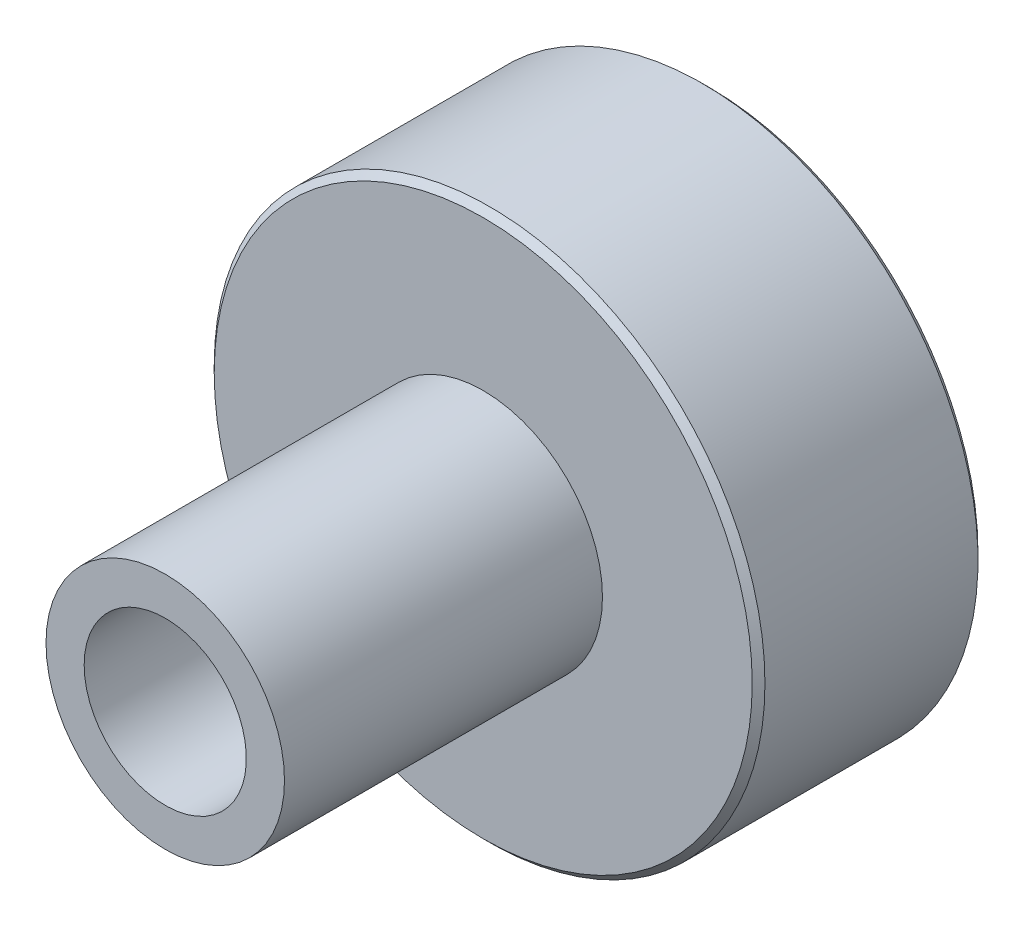
ISO-10303-21;
HEADER;
FILE_DESCRIPTION(('STEP AP214'),'2;1');
FILE_NAME('part.step','',(''),(''),'','','');
FILE_SCHEMA(('AUTOMOTIVE_DESIGN { 1 0 10303 214 1 1 1 1 }'));
ENDSEC;
DATA;
#1=APPLICATION_CONTEXT('core data for automotive mechanical design processes');
#2=APPLICATION_PROTOCOL_DEFINITION('international standard','automotive_design',2000,#1);
#3=PRODUCT_CONTEXT('',#1,'mechanical');
#4=PRODUCT('Part','Part','',(#3));
#5=PRODUCT_RELATED_PRODUCT_CATEGORY('part','',(#4));
#6=PRODUCT_DEFINITION_FORMATION('','',#4);
#7=PRODUCT_DEFINITION_CONTEXT('part definition',#1,'design');
#8=PRODUCT_DEFINITION('design','',#6,#7);
#9=PRODUCT_DEFINITION_SHAPE('','',#8);
#10=(LENGTH_UNIT() NAMED_UNIT(*) SI_UNIT(.MILLI.,.METRE.));
#11=(NAMED_UNIT(*) PLANE_ANGLE_UNIT() SI_UNIT($,.RADIAN.));
#12=(NAMED_UNIT(*) SI_UNIT($,.STERADIAN.) SOLID_ANGLE_UNIT());
#13=UNCERTAINTY_MEASURE_WITH_UNIT(LENGTH_MEASURE(1.E-05),#10,'distance_accuracy_value','');
#14=(GEOMETRIC_REPRESENTATION_CONTEXT(3) GLOBAL_UNCERTAINTY_ASSIGNED_CONTEXT((#13)) GLOBAL_UNIT_ASSIGNED_CONTEXT((#10,
#11,#12)) REPRESENTATION_CONTEXT('',''));
#15=CARTESIAN_POINT('',(0.,0.,0.));
#16=DIRECTION('',(0.,0.,1.));
#17=DIRECTION('',(1.,0.,0.));
#18=AXIS2_PLACEMENT_3D('',#15,#16,#17);
#19=CARTESIAN_POINT('',(0.,0.,12.7));
#20=DIRECTION('',(0.,0.,-1.));
#21=DIRECTION('',(-1.,0.,0.));
#22=AXIS2_PLACEMENT_3D('',#19,#20,#21);
#23=CYLINDRICAL_SURFACE('',#22,3.2385);
#24=CARTESIAN_POINT('',(0.,0.,12.7));
#25=DIRECTION('',(0.,0.,-1.));
#26=DIRECTION('',(-1.,0.,0.));
#27=AXIS2_PLACEMENT_3D('',#24,#25,#26);
#28=CIRCLE('',#27,3.2385);
#29=CARTESIAN_POINT('',(-3.2385,0.,12.7));
#30=VERTEX_POINT('',#29);
#31=EDGE_CURVE('E38',#30,#30,#28,.T.);
#32=ORIENTED_EDGE('',*,*,#31,.F.);
#33=EDGE_LOOP('',(#32));
#34=FACE_BOUND('',#33,.T.);
#35=CARTESIAN_POINT('',(0.,0.,-1.27));
#36=DIRECTION('',(0.,0.,-1.));
#37=DIRECTION('',(-1.,0.,0.));
#38=AXIS2_PLACEMENT_3D('',#35,#36,#37);
#39=CIRCLE('',#38,3.2385);
#40=CARTESIAN_POINT('',(-3.2385,0.,-1.27));
#41=VERTEX_POINT('',#40);
#42=EDGE_CURVE('E35',#41,#41,#39,.F.);
#43=ORIENTED_EDGE('',*,*,#42,.F.);
#44=EDGE_LOOP('',(#43));
#45=FACE_BOUND('',#44,.T.);
#46=ADVANCED_FACE('F14',(#34,#45),#23,.F.);
#47=CARTESIAN_POINT('',(0.,0.,-9.017));
#48=DIRECTION('',(0.,0.,-1.));
#49=DIRECTION('',(-1.,0.,0.));
#50=AXIS2_PLACEMENT_3D('',#47,#48,#49);
#51=PLANE('',#50);
#52=CARTESIAN_POINT('',(0.,0.,-9.017));
#53=DIRECTION('',(0.,0.,-1.));
#54=DIRECTION('',(-1.,0.,0.));
#55=AXIS2_PLACEMENT_3D('',#52,#53,#54);
#56=CIRCLE('',#55,10.7442);
#57=CARTESIAN_POINT('',(-10.7442,0.,-9.017));
#58=VERTEX_POINT('',#57);
#59=EDGE_CURVE('E29',#58,#58,#56,.T.);
#60=ORIENTED_EDGE('',*,*,#59,.T.);
#61=EDGE_LOOP('',(#60));
#62=FACE_BOUND('',#61,.T.);
#63=CARTESIAN_POINT('',(0.,0.,-9.017));
#64=DIRECTION('',(0.,0.,-1.));
#65=DIRECTION('',(-1.,0.,0.));
#66=AXIS2_PLACEMENT_3D('',#63,#64,#65);
#67=CIRCLE('',#66,5.08);
#68=CARTESIAN_POINT('',(-5.08,0.,-9.017));
#69=VERTEX_POINT('',#68);
#70=EDGE_CURVE('E47',#69,#69,#67,.T.);
#71=ORIENTED_EDGE('',*,*,#70,.F.);
#72=EDGE_LOOP('',(#71));
#73=FACE_BOUND('',#72,.T.);
#74=ADVANCED_FACE('F63',(#62,#73),#51,.T.);
#75=CARTESIAN_POINT('',(0.,0.,-78.9136340269278));
#76=DIRECTION('',(0.,0.,-1.));
#77=DIRECTION('',(-1.,0.,0.));
#78=AXIS2_PLACEMENT_3D('',#75,#76,#77);
#79=CYLINDRICAL_SURFACE('',#78,10.9982);
#80=CARTESIAN_POINT('',(0.,0.,-8.763));
#81=DIRECTION('',(0.,0.,-1.));
#82=DIRECTION('',(-1.,0.,0.));
#83=AXIS2_PLACEMENT_3D('',#80,#81,#82);
#84=CIRCLE('',#83,10.9982);
#85=CARTESIAN_POINT('',(-10.9982,0.,-8.763));
#86=VERTEX_POINT('',#85);
#87=EDGE_CURVE('E21',#86,#86,#84,.F.);
#88=ORIENTED_EDGE('',*,*,#87,.T.);
#89=EDGE_LOOP('',(#88));
#90=FACE_BOUND('',#89,.T.);
#91=CARTESIAN_POINT('',(0.,0.,-0.254000000000008));
#92=DIRECTION('',(0.,0.,1.));
#93=DIRECTION('',(1.,0.,0.));
#94=AXIS2_PLACEMENT_3D('',#91,#92,#93);
#95=CIRCLE('',#94,10.9982);
#96=CARTESIAN_POINT('',(10.9982,0.,-0.254000000000008));
#97=VERTEX_POINT('',#96);
#98=EDGE_CURVE('E25',#97,#97,#95,.F.);
#99=ORIENTED_EDGE('',*,*,#98,.T.);
#100=EDGE_LOOP('',(#99));
#101=FACE_BOUND('',#100,.T.);
#102=ADVANCED_FACE('F65',(#90,#101),#79,.T.);
#103=CARTESIAN_POINT('',(-10.9982,0.,0.));
#104=DIRECTION('',(0.,0.,1.));
#105=DIRECTION('',(1.,0.,0.));
#106=AXIS2_PLACEMENT_3D('',#103,#104,#105);
#107=PLANE('',#106);
#108=CARTESIAN_POINT('',(0.,0.,0.));
#109=DIRECTION('',(0.,0.,1.));
#110=DIRECTION('',(1.,0.,0.));
#111=AXIS2_PLACEMENT_3D('',#108,#109,#110);
#112=CIRCLE('',#111,10.7442);
#113=CARTESIAN_POINT('',(10.7442,0.,0.));
#114=VERTEX_POINT('',#113);
#115=EDGE_CURVE('E9',#114,#114,#112,.T.);
#116=ORIENTED_EDGE('',*,*,#115,.T.);
#117=EDGE_LOOP('',(#116));
#118=FACE_BOUND('',#117,.T.);
#119=CARTESIAN_POINT('',(0.,0.,0.));
#120=DIRECTION('',(0.,0.,-1.));
#121=DIRECTION('',(-1.,0.,0.));
#122=AXIS2_PLACEMENT_3D('',#119,#120,#121);
#123=CIRCLE('',#122,4.76249999999999);
#124=CARTESIAN_POINT('',(-4.76249999999999,0.,0.));
#125=VERTEX_POINT('',#124);
#126=EDGE_CURVE('E34',#125,#125,#123,.T.);
#127=ORIENTED_EDGE('',*,*,#126,.T.);
#128=EDGE_LOOP('',(#127));
#129=FACE_BOUND('',#128,.T.);
#130=ADVANCED_FACE('F73',(#118,#129),#107,.T.);
#131=CARTESIAN_POINT('',(0.,0.,-78.9136340269278));
#132=DIRECTION('',(0.,0.,-1.));
#133=DIRECTION('',(-1.,0.,0.));
#134=AXIS2_PLACEMENT_3D('',#131,#132,#133);
#135=CYLINDRICAL_SURFACE('',#134,4.76249999999999);
#136=CARTESIAN_POINT('',(0.,0.,12.7));
#137=DIRECTION('',(0.,0.,-1.));
#138=DIRECTION('',(-1.,0.,0.));
#139=AXIS2_PLACEMENT_3D('',#136,#137,#138);
#140=CIRCLE('',#139,4.76249999999999);
#141=CARTESIAN_POINT('',(-4.76249999999999,0.,12.7));
#142=VERTEX_POINT('',#141);
#143=EDGE_CURVE('E42',#142,#142,#140,.T.);
#144=ORIENTED_EDGE('',*,*,#143,.T.);
#145=EDGE_LOOP('',(#144));
#146=FACE_BOUND('',#145,.T.);
#147=ORIENTED_EDGE('',*,*,#126,.F.);
#148=EDGE_LOOP('',(#147));
#149=FACE_BOUND('',#148,.T.);
#150=ADVANCED_FACE('F124',(#146,#149),#135,.T.);
#151=CARTESIAN_POINT('',(-4.76249999999999,0.,12.7));
#152=DIRECTION('',(0.,0.,1.));
#153=DIRECTION('',(1.,0.,0.));
#154=AXIS2_PLACEMENT_3D('',#151,#152,#153);
#155=PLANE('',#154);
#156=ORIENTED_EDGE('',*,*,#31,.T.);
#157=EDGE_LOOP('',(#156));
#158=FACE_BOUND('',#157,.T.);
#159=ORIENTED_EDGE('',*,*,#143,.F.);
#160=EDGE_LOOP('',(#159));
#161=FACE_BOUND('',#160,.T.);
#162=ADVANCED_FACE('F115',(#158,#161),#155,.T.);
#163=CARTESIAN_POINT('',(0.,0.,-1.27));
#164=DIRECTION('',(0.,0.,-1.));
#165=DIRECTION('',(-1.,0.,0.));
#166=AXIS2_PLACEMENT_3D('',#163,#164,#165);
#167=PLANE('',#166);
#168=CARTESIAN_POINT('',(0.,0.,-1.27));
#169=DIRECTION('',(0.,0.,-1.));
#170=DIRECTION('',(-1.,0.,0.));
#171=AXIS2_PLACEMENT_3D('',#168,#169,#170);
#172=CIRCLE('',#171,5.08);
#173=CARTESIAN_POINT('',(-5.08,0.,-1.27));
#174=VERTEX_POINT('',#173);
#175=EDGE_CURVE('E39',#174,#174,#172,.T.);
#176=ORIENTED_EDGE('',*,*,#175,.T.);
#177=EDGE_LOOP('',(#176));
#178=FACE_BOUND('',#177,.T.);
#179=ORIENTED_EDGE('',*,*,#42,.T.);
#180=EDGE_LOOP('',(#179));
#181=FACE_BOUND('',#180,.T.);
#182=ADVANCED_FACE('F53',(#178,#181),#167,.T.);
#183=CARTESIAN_POINT('',(0.,0.,-1.27));
#184=DIRECTION('',(0.,0.,-1.));
#185=DIRECTION('',(-1.,0.,0.));
#186=AXIS2_PLACEMENT_3D('',#183,#184,#185);
#187=CYLINDRICAL_SURFACE('',#186,5.08);
#188=ORIENTED_EDGE('',*,*,#175,.F.);
#189=EDGE_LOOP('',(#188));
#190=FACE_BOUND('',#189,.T.);
#191=ORIENTED_EDGE('',*,*,#70,.T.);
#192=EDGE_LOOP('',(#191));
#193=FACE_BOUND('',#192,.T.);
#194=ADVANCED_FACE('F56',(#190,#193),#187,.F.);
#195=CARTESIAN_POINT('',(0.,0.,-9.017));
#196=DIRECTION('',(0.,0.,1.));
#197=DIRECTION('',(1.,0.,0.));
#198=AXIS2_PLACEMENT_3D('',#195,#196,#197);
#199=CONICAL_SURFACE('',#198,10.7442,0.785398163397442);
#200=ORIENTED_EDGE('',*,*,#87,.F.);
#201=EDGE_LOOP('',(#200));
#202=FACE_BOUND('',#201,.T.);
#203=ORIENTED_EDGE('',*,*,#59,.F.);
#204=EDGE_LOOP('',(#203));
#205=FACE_BOUND('',#204,.T.);
#206=ADVANCED_FACE('F59',(#202,#205),#199,.T.);
#207=CARTESIAN_POINT('',(0.,0.,-0.254000000000008));
#208=DIRECTION('',(0.,0.,-1.));
#209=DIRECTION('',(-1.,0.,0.));
#210=AXIS2_PLACEMENT_3D('',#207,#208,#209);
#211=CONICAL_SURFACE('',#210,10.9982,0.785398163397462);
#212=ORIENTED_EDGE('',*,*,#115,.F.);
#213=EDGE_LOOP('',(#212));
#214=FACE_BOUND('',#213,.T.);
#215=ORIENTED_EDGE('',*,*,#98,.F.);
#216=EDGE_LOOP('',(#215));
#217=FACE_BOUND('',#216,.T.);
#218=ADVANCED_FACE('F16',(#214,#217),#211,.T.);
#219=CLOSED_SHELL('',(#46,#74,#102,#130,#150,#162,#182,#194,#206,#218));
#220=MANIFOLD_SOLID_BREP('B1',#219);
#221=ADVANCED_BREP_SHAPE_REPRESENTATION('',(#18,#220),#14);
#222=SHAPE_DEFINITION_REPRESENTATION(#9,#221);
ENDSEC;
END-ISO-10303-21;
